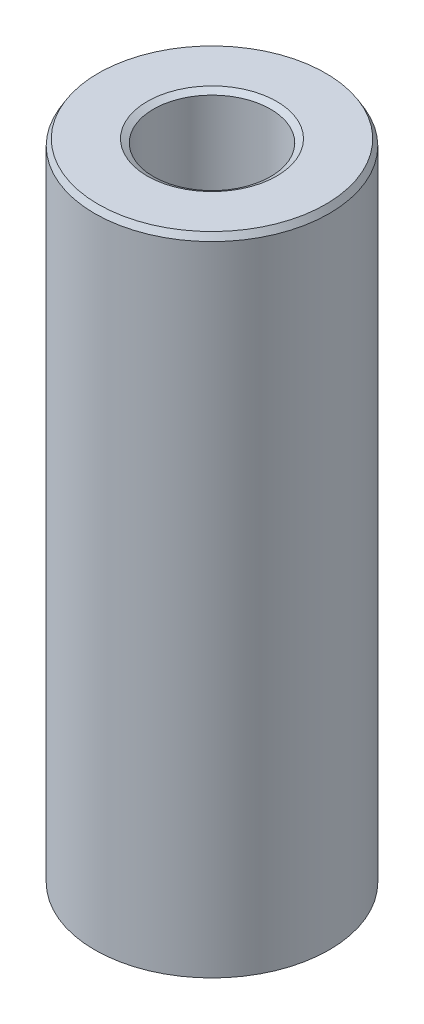
ISO-10303-21;
HEADER;
FILE_DESCRIPTION(('STEP AP214'),'2;1');
FILE_NAME('part.step','',(''),(''),'','','');
FILE_SCHEMA(('AUTOMOTIVE_DESIGN { 1 0 10303 214 1 1 1 1 }'));
ENDSEC;
DATA;
#1=APPLICATION_CONTEXT('core data for automotive mechanical design processes');
#2=APPLICATION_PROTOCOL_DEFINITION('international standard','automotive_design',2000,#1);
#3=PRODUCT_CONTEXT('',#1,'mechanical');
#4=PRODUCT('Part','Part','',(#3));
#5=PRODUCT_RELATED_PRODUCT_CATEGORY('part','',(#4));
#6=PRODUCT_DEFINITION_FORMATION('','',#4);
#7=PRODUCT_DEFINITION_CONTEXT('part definition',#1,'design');
#8=PRODUCT_DEFINITION('design','',#6,#7);
#9=PRODUCT_DEFINITION_SHAPE('','',#8);
#10=(LENGTH_UNIT() NAMED_UNIT(*) SI_UNIT(.MILLI.,.METRE.));
#11=(NAMED_UNIT(*) PLANE_ANGLE_UNIT() SI_UNIT($,.RADIAN.));
#12=(NAMED_UNIT(*) SI_UNIT($,.STERADIAN.) SOLID_ANGLE_UNIT());
#13=UNCERTAINTY_MEASURE_WITH_UNIT(LENGTH_MEASURE(1.E-05),#10,'distance_accuracy_value','');
#14=(GEOMETRIC_REPRESENTATION_CONTEXT(3) GLOBAL_UNCERTAINTY_ASSIGNED_CONTEXT((#13)) GLOBAL_UNIT_ASSIGNED_CONTEXT((#10,
#11,#12)) REPRESENTATION_CONTEXT('',''));
#15=CARTESIAN_POINT('',(0.,0.,0.));
#16=DIRECTION('',(0.,0.,1.));
#17=DIRECTION('',(1.,0.,0.));
#18=AXIS2_PLACEMENT_3D('',#15,#16,#17);
#19=CARTESIAN_POINT('',(0.,124.259235383179,0.));
#20=DIRECTION('',(0.,-1.,0.));
#21=DIRECTION('',(0.,0.,-1.));
#22=AXIS2_PLACEMENT_3D('',#19,#20,#21);
#23=CYLINDRICAL_SURFACE('',#22,22.5);
#24=CARTESIAN_POINT('',(0.,0.685582970011381,0.));
#25=DIRECTION('',(0.,1.,0.));
#26=DIRECTION('',(0.,0.,1.));
#27=AXIS2_PLACEMENT_3D('',#24,#25,#26);
#28=CIRCLE('',#27,22.5);
#29=CARTESIAN_POINT('',(0.,0.685582970011381,22.5));
#30=VERTEX_POINT('',#29);
#31=EDGE_CURVE('E10',#30,#30,#28,.T.);
#32=ORIENTED_EDGE('',*,*,#31,.T.);
#33=EDGE_LOOP('',(#32));
#34=FACE_BOUND('',#33,.T.);
#35=CARTESIAN_POINT('',(0.,123.071770846316,0.));
#36=DIRECTION('',(0.,1.,0.));
#37=DIRECTION('',(0.,0.,1.));
#38=AXIS2_PLACEMENT_3D('',#35,#36,#37);
#39=CIRCLE('',#38,22.5);
#40=CARTESIAN_POINT('',(0.,123.071770846316,22.5));
#41=VERTEX_POINT('',#40);
#42=EDGE_CURVE('E50',#41,#41,#39,.F.);
#43=ORIENTED_EDGE('',*,*,#42,.T.);
#44=EDGE_LOOP('',(#43));
#45=FACE_BOUND('',#44,.T.);
#46=ADVANCED_FACE('F39',(#34,#45),#23,.T.);
#47=CARTESIAN_POINT('',(0.,124.259235383179,0.));
#48=DIRECTION('',(0.,1.,0.));
#49=DIRECTION('',(0.,0.,1.));
#50=AXIS2_PLACEMENT_3D('',#47,#48,#49);
#51=PLANE('',#50);
#52=CARTESIAN_POINT('',(0.,124.259235383179,0.));
#53=DIRECTION('',(0.,1.,0.));
#54=DIRECTION('',(0.,0.,1.));
#55=AXIS2_PLACEMENT_3D('',#52,#53,#54);
#56=CIRCLE('',#55,12.4218110522387);
#57=CARTESIAN_POINT('',(0.,124.259235383179,12.4218110522387));
#58=VERTEX_POINT('',#57);
#59=EDGE_CURVE('E58',#58,#58,#56,.F.);
#60=ORIENTED_EDGE('',*,*,#59,.T.);
#61=EDGE_LOOP('',(#60));
#62=FACE_BOUND('',#61,.T.);
#63=CARTESIAN_POINT('',(0.,124.259235383179,0.));
#64=DIRECTION('',(0.,1.,0.));
#65=DIRECTION('',(0.,0.,1.));
#66=AXIS2_PLACEMENT_3D('',#63,#64,#65);
#67=CIRCLE('',#66,21.8144170299886);
#68=CARTESIAN_POINT('',(0.,124.259235383179,21.8144170299886));
#69=VERTEX_POINT('',#68);
#70=EDGE_CURVE('E61',#69,#69,#67,.T.);
#71=ORIENTED_EDGE('',*,*,#70,.T.);
#72=EDGE_LOOP('',(#71));
#73=FACE_BOUND('',#72,.T.);
#74=ADVANCED_FACE('F88',(#62,#73),#51,.T.);
#75=CARTESIAN_POINT('',(0.,0.,0.));
#76=DIRECTION('',(0.,1.,0.));
#77=DIRECTION('',(0.,0.,1.));
#78=AXIS2_PLACEMENT_3D('',#75,#76,#77);
#79=PLANE('',#78);
#80=CARTESIAN_POINT('',(0.,0.,0.));
#81=DIRECTION('',(0.,1.,0.));
#82=DIRECTION('',(0.,0.,1.));
#83=AXIS2_PLACEMENT_3D('',#80,#81,#82);
#84=CIRCLE('',#83,11.9199294853864);
#85=CARTESIAN_POINT('',(0.,0.,11.9199294853864));
#86=VERTEX_POINT('',#85);
#87=EDGE_CURVE('E51',#86,#86,#84,.T.);
#88=ORIENTED_EDGE('',*,*,#87,.T.);
#89=EDGE_LOOP('',(#88));
#90=FACE_BOUND('',#89,.T.);
#91=CARTESIAN_POINT('',(0.,0.,0.));
#92=DIRECTION('',(0.,1.,0.));
#93=DIRECTION('',(0.,0.,1.));
#94=AXIS2_PLACEMENT_3D('',#91,#92,#93);
#95=CIRCLE('',#94,21.3125354631363);
#96=CARTESIAN_POINT('',(0.,0.,21.3125354631363));
#97=VERTEX_POINT('',#96);
#98=EDGE_CURVE('E54',#97,#97,#95,.F.);
#99=ORIENTED_EDGE('',*,*,#98,.T.);
#100=EDGE_LOOP('',(#99));
#101=FACE_BOUND('',#100,.T.);
#102=ADVANCED_FACE('F83',(#90,#101),#79,.F.);
#103=CARTESIAN_POINT('',(0.,124.259235383179,0.));
#104=DIRECTION('',(0.,-1.,0.));
#105=DIRECTION('',(0.,0.,-1.));
#106=AXIS2_PLACEMENT_3D('',#103,#104,#105);
#107=CYLINDRICAL_SURFACE('',#106,11.234346515375);
#108=CARTESIAN_POINT('',(0.,123.573652413168,0.));
#109=DIRECTION('',(0.,1.,0.));
#110=DIRECTION('',(0.,0.,1.));
#111=AXIS2_PLACEMENT_3D('',#108,#109,#110);
#112=CIRCLE('',#111,11.234346515375);
#113=CARTESIAN_POINT('',(0.,123.573652413168,11.234346515375));
#114=VERTEX_POINT('',#113);
#115=EDGE_CURVE('E67',#114,#114,#112,.T.);
#116=ORIENTED_EDGE('',*,*,#115,.T.);
#117=EDGE_LOOP('',(#116));
#118=FACE_BOUND('',#117,.T.);
#119=CARTESIAN_POINT('',(0.,1.18746453686368,0.));
#120=DIRECTION('',(0.,1.,0.));
#121=DIRECTION('',(0.,0.,1.));
#122=AXIS2_PLACEMENT_3D('',#119,#120,#121);
#123=CIRCLE('',#122,11.234346515375);
#124=CARTESIAN_POINT('',(0.,1.18746453686368,11.234346515375));
#125=VERTEX_POINT('',#124);
#126=EDGE_CURVE('E69',#125,#125,#123,.F.);
#127=ORIENTED_EDGE('',*,*,#126,.T.);
#128=EDGE_LOOP('',(#127));
#129=FACE_BOUND('',#128,.T.);
#130=ADVANCED_FACE('F71',(#118,#129),#107,.F.);
#131=CARTESIAN_POINT('',(0.,123.573652413168,0.));
#132=DIRECTION('',(0.,1.,0.));
#133=DIRECTION('',(0.,0.,1.));
#134=AXIS2_PLACEMENT_3D('',#131,#132,#133);
#135=CONICAL_SURFACE('',#134,11.234346515375,1.0471975511966);
#136=ORIENTED_EDGE('',*,*,#59,.F.);
#137=EDGE_LOOP('',(#136));
#138=FACE_BOUND('',#137,.T.);
#139=ORIENTED_EDGE('',*,*,#115,.F.);
#140=EDGE_LOOP('',(#139));
#141=FACE_BOUND('',#140,.T.);
#142=ADVANCED_FACE('F77',(#138,#141),#135,.F.);
#143=CARTESIAN_POINT('',(0.,0.,0.));
#144=DIRECTION('',(0.,-1.,0.));
#145=DIRECTION('',(0.,0.,-1.));
#146=AXIS2_PLACEMENT_3D('',#143,#144,#145);
#147=CONICAL_SURFACE('',#146,11.9199294853864,0.523598775598293);
#148=ORIENTED_EDGE('',*,*,#126,.F.);
#149=EDGE_LOOP('',(#148));
#150=FACE_BOUND('',#149,.T.);
#151=ORIENTED_EDGE('',*,*,#87,.F.);
#152=EDGE_LOOP('',(#151));
#153=FACE_BOUND('',#152,.T.);
#154=ADVANCED_FACE('F73',(#150,#153),#147,.F.);
#155=CARTESIAN_POINT('',(0.,0.685582970011381,0.));
#156=DIRECTION('',(0.,1.,0.));
#157=DIRECTION('',(0.,0.,1.));
#158=AXIS2_PLACEMENT_3D('',#155,#156,#157);
#159=CONICAL_SURFACE('',#158,22.5,1.04719755119661);
#160=ORIENTED_EDGE('',*,*,#98,.F.);
#161=EDGE_LOOP('',(#160));
#162=FACE_BOUND('',#161,.T.);
#163=ORIENTED_EDGE('',*,*,#31,.F.);
#164=EDGE_LOOP('',(#163));
#165=FACE_BOUND('',#164,.T.);
#166=ADVANCED_FACE('F76',(#162,#165),#159,.T.);
#167=CARTESIAN_POINT('',(0.,124.259235383179,0.));
#168=DIRECTION('',(0.,-1.,0.));
#169=DIRECTION('',(0.,0.,-1.));
#170=AXIS2_PLACEMENT_3D('',#167,#168,#169);
#171=CONICAL_SURFACE('',#170,21.8144170299886,0.523598775598299);
#172=ORIENTED_EDGE('',*,*,#42,.F.);
#173=EDGE_LOOP('',(#172));
#174=FACE_BOUND('',#173,.T.);
#175=ORIENTED_EDGE('',*,*,#70,.F.);
#176=EDGE_LOOP('',(#175));
#177=FACE_BOUND('',#176,.T.);
#178=ADVANCED_FACE('F45',(#174,#177),#171,.T.);
#179=CLOSED_SHELL('',(#46,#74,#102,#130,#142,#154,#166,#178));
#180=MANIFOLD_SOLID_BREP('B2',#179);
#181=ADVANCED_BREP_SHAPE_REPRESENTATION('',(#18,#180),#14);
#182=SHAPE_DEFINITION_REPRESENTATION(#9,#181);
ENDSEC;
END-ISO-10303-21;
